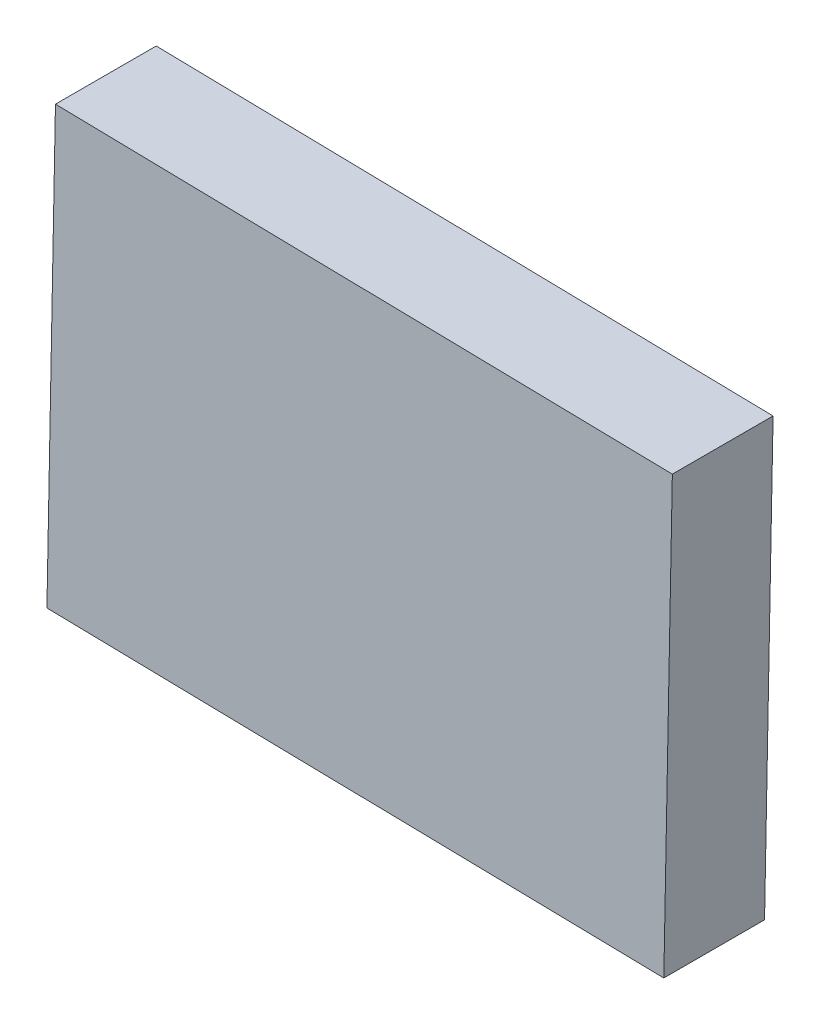
ISO-10303-21;
HEADER;
FILE_DESCRIPTION(('STEP AP214'),'2;1');
FILE_NAME('part.step','',(''),(''),'','','');
FILE_SCHEMA(('AUTOMOTIVE_DESIGN { 1 0 10303 214 1 1 1 1 }'));
ENDSEC;
DATA;
#1=APPLICATION_CONTEXT('core data for automotive mechanical design processes');
#2=APPLICATION_PROTOCOL_DEFINITION('international standard','automotive_design',2000,#1);
#3=PRODUCT_CONTEXT('',#1,'mechanical');
#4=PRODUCT('Part','Part','',(#3));
#5=PRODUCT_RELATED_PRODUCT_CATEGORY('part','',(#4));
#6=PRODUCT_DEFINITION_FORMATION('','',#4);
#7=PRODUCT_DEFINITION_CONTEXT('part definition',#1,'design');
#8=PRODUCT_DEFINITION('design','',#6,#7);
#9=PRODUCT_DEFINITION_SHAPE('','',#8);
#10=(LENGTH_UNIT() NAMED_UNIT(*) SI_UNIT(.MILLI.,.METRE.));
#11=(NAMED_UNIT(*) PLANE_ANGLE_UNIT() SI_UNIT($,.RADIAN.));
#12=(NAMED_UNIT(*) SI_UNIT($,.STERADIAN.) SOLID_ANGLE_UNIT());
#13=UNCERTAINTY_MEASURE_WITH_UNIT(LENGTH_MEASURE(1.E-05),#10,'distance_accuracy_value','');
#14=(GEOMETRIC_REPRESENTATION_CONTEXT(3) GLOBAL_UNCERTAINTY_ASSIGNED_CONTEXT((#13)) GLOBAL_UNIT_ASSIGNED_CONTEXT((#10,
#11,#12)) REPRESENTATION_CONTEXT('',''));
#15=CARTESIAN_POINT('',(0.,0.,0.));
#16=DIRECTION('',(0.,0.,1.));
#17=DIRECTION('',(1.,0.,0.));
#18=AXIS2_PLACEMENT_3D('',#15,#16,#17);
#19=CARTESIAN_POINT('',(-1.71669371262008,0.557184606220066,38.2500965279299));
#20=DIRECTION('',(0.,0.,-1.));
#21=DIRECTION('',(-0.0193548335692301,-0.999812677663925,0.));
#22=AXIS2_PLACEMENT_3D('',#19,#20,#21);
#23=PLANE('',#22);
#24=DIRECTION('',(-0.0193548335692301,-0.999812677663925,0.));
#25=VECTOR('',#24,1.);
#26=CARTESIAN_POINT('',(4.59117281569775,4.88090682913489,38.25009652793));
#27=LINE('',#26,#25);
#28=CARTESIAN_POINT('',(4.59117281569775,4.88090682913489,38.25009652793));
#29=VERTEX_POINT('',#28);
#30=CARTESIAN_POINT('',(4.4191083452673,-4.0074278752974,38.2500965279301));
#31=VERTEX_POINT('',#30);
#32=EDGE_CURVE('E59',#29,#31,#27,.T.);
#33=ORIENTED_EDGE('',*,*,#32,.T.);
#34=DIRECTION('',(-0.999812677663925,0.0193548335692301,0.));
#35=VECTOR('',#34,1.);
#36=CARTESIAN_POINT('',(4.4191083452673,-4.0074278752974,38.2500965279301));
#37=LINE('',#36,#35);
#38=CARTESIAN_POINT('',(-8.02456024093791,-3.76653761669476,38.2500965279297));
#39=VERTEX_POINT('',#38);
#40=EDGE_CURVE('E20',#31,#39,#37,.T.);
#41=ORIENTED_EDGE('',*,*,#40,.T.);
#42=DIRECTION('',(0.0193548335692301,0.999812677663925,0.));
#43=VECTOR('',#42,1.);
#44=CARTESIAN_POINT('',(-7.85249577050745,5.12179708773753,38.2500965279296));
#45=LINE('',#44,#43);
#46=CARTESIAN_POINT('',(-7.85249577050745,5.12179708773753,38.2500965279296));
#47=VERTEX_POINT('',#46);
#48=EDGE_CURVE('E56',#39,#47,#45,.T.);
#49=ORIENTED_EDGE('',*,*,#48,.T.);
#50=DIRECTION('',(0.999812677663925,-0.0193548335692301,0.));
#51=VECTOR('',#50,1.);
#52=CARTESIAN_POINT('',(4.59117281569775,4.88090682913489,38.25009652793));
#53=LINE('',#52,#51);
#54=EDGE_CURVE('E84',#47,#29,#53,.T.);
#55=ORIENTED_EDGE('',*,*,#54,.T.);
#56=EDGE_LOOP('',(#33,#41,#49,#55));
#57=FACE_BOUND('',#56,.T.);
#58=ADVANCED_FACE('F17',(#57),#23,.T.);
#59=CARTESIAN_POINT('',(4.41910834526723,-4.00742787529737,40.2820965279302));
#60=DIRECTION('',(0.0193548335692301,0.999812677663925,0.));
#61=DIRECTION('',(-0.999812677663925,0.0193548335692301,0.));
#62=AXIS2_PLACEMENT_3D('',#59,#60,#61);
#63=PLANE('',#62);
#64=DIRECTION('',(0.,0.,1.));
#65=VECTOR('',#64,1.);
#66=CARTESIAN_POINT('',(-8.02456024093798,-3.76653761669474,40.2820965279298));
#67=LINE('',#66,#65);
#68=CARTESIAN_POINT('',(-8.02456024093798,-3.76653761669474,40.2820965279298));
#69=VERTEX_POINT('',#68);
#70=EDGE_CURVE('E65',#69,#39,#67,.F.);
#71=ORIENTED_EDGE('',*,*,#70,.T.);
#72=ORIENTED_EDGE('',*,*,#40,.F.);
#73=DIRECTION('',(0.,0.,1.));
#74=VECTOR('',#73,1.);
#75=CARTESIAN_POINT('',(4.41910834526723,-4.00742787529737,40.2820965279302));
#76=LINE('',#75,#74);
#77=CARTESIAN_POINT('',(4.41910834526723,-4.00742787529737,40.2820965279302));
#78=VERTEX_POINT('',#77);
#79=EDGE_CURVE('E89',#31,#78,#76,.T.);
#80=ORIENTED_EDGE('',*,*,#79,.T.);
#81=DIRECTION('',(-0.999812677663925,0.0193548335692301,0.));
#82=VECTOR('',#81,1.);
#83=CARTESIAN_POINT('',(-1.80272594783537,-3.88698274599605,40.28209652793));
#84=LINE('',#83,#82);
#85=EDGE_CURVE('E76',#78,#69,#84,.T.);
#86=ORIENTED_EDGE('',*,*,#85,.T.);
#87=EDGE_LOOP('',(#71,#72,#80,#86));
#88=FACE_BOUND('',#87,.T.);
#89=ADVANCED_FACE('F75',(#88),#63,.F.);
#90=CARTESIAN_POINT('',(-7.85249577050752,5.12179708773756,40.2820965279296));
#91=DIRECTION('',(0.999812677663925,-0.0193548335692301,0.));
#92=DIRECTION('',(0.0193548335692301,0.999812677663925,0.));
#93=AXIS2_PLACEMENT_3D('',#90,#91,#92);
#94=PLANE('',#93);
#95=DIRECTION('',(0.,0.,1.));
#96=VECTOR('',#95,1.);
#97=CARTESIAN_POINT('',(-7.85249577050752,5.12179708773756,40.2820965279296));
#98=LINE('',#97,#96);
#99=CARTESIAN_POINT('',(-7.85249577050752,5.12179708773756,40.2820965279296));
#100=VERTEX_POINT('',#99);
#101=EDGE_CURVE('E71',#100,#47,#98,.F.);
#102=ORIENTED_EDGE('',*,*,#101,.T.);
#103=ORIENTED_EDGE('',*,*,#48,.F.);
#104=ORIENTED_EDGE('',*,*,#70,.F.);
#105=DIRECTION('',(-0.0193548335692301,-0.999812677663925,0.));
#106=VECTOR('',#105,1.);
#107=CARTESIAN_POINT('',(-7.93852800572275,0.677629735521414,40.2820965279297));
#108=LINE('',#107,#106);
#109=EDGE_CURVE('E94',#69,#100,#108,.F.);
#110=ORIENTED_EDGE('',*,*,#109,.T.);
#111=EDGE_LOOP('',(#102,#103,#104,#110));
#112=FACE_BOUND('',#111,.T.);
#113=ADVANCED_FACE('F68',(#112),#94,.F.);
#114=CARTESIAN_POINT('',(4.59117281569769,4.88090682913492,40.28209652793));
#115=DIRECTION('',(-0.0193548335692301,-0.999812677663925,0.));
#116=DIRECTION('',(0.999812677663925,-0.0193548335692301,0.));
#117=AXIS2_PLACEMENT_3D('',#114,#115,#116);
#118=PLANE('',#117);
#119=DIRECTION('',(0.,0.,1.));
#120=VECTOR('',#119,1.);
#121=CARTESIAN_POINT('',(4.59117281569769,4.88090682913492,40.28209652793));
#122=LINE('',#121,#120);
#123=CARTESIAN_POINT('',(4.59117281569769,4.88090682913492,40.28209652793));
#124=VERTEX_POINT('',#123);
#125=EDGE_CURVE('E35',#124,#29,#122,.F.);
#126=ORIENTED_EDGE('',*,*,#125,.T.);
#127=ORIENTED_EDGE('',*,*,#54,.F.);
#128=ORIENTED_EDGE('',*,*,#101,.F.);
#129=DIRECTION('',(-0.999812677663925,0.0193548335692301,0.));
#130=VECTOR('',#129,1.);
#131=CARTESIAN_POINT('',(-1.63066147740492,5.00135195843624,40.2820965279298));
#132=LINE('',#131,#130);
#133=EDGE_CURVE('E27',#100,#124,#132,.F.);
#134=ORIENTED_EDGE('',*,*,#133,.T.);
#135=EDGE_LOOP('',(#126,#127,#128,#134));
#136=FACE_BOUND('',#135,.T.);
#137=ADVANCED_FACE('F101',(#136),#118,.F.);
#138=CARTESIAN_POINT('',(4.59117281569769,4.88090682913492,40.28209652793));
#139=DIRECTION('',(-0.999812677663925,0.0193548335692301,0.));
#140=DIRECTION('',(-0.0193548335692301,-0.999812677663925,0.));
#141=AXIS2_PLACEMENT_3D('',#138,#139,#140);
#142=PLANE('',#141);
#143=ORIENTED_EDGE('',*,*,#79,.F.);
#144=ORIENTED_EDGE('',*,*,#32,.F.);
#145=ORIENTED_EDGE('',*,*,#125,.F.);
#146=DIRECTION('',(-0.0193548335692301,-0.999812677663925,0.));
#147=VECTOR('',#146,1.);
#148=CARTESIAN_POINT('',(4.50514058048246,0.436739476918776,40.2820965279301));
#149=LINE('',#148,#147);
#150=EDGE_CURVE('E11',#124,#78,#149,.T.);
#151=ORIENTED_EDGE('',*,*,#150,.T.);
#152=EDGE_LOOP('',(#143,#144,#145,#151));
#153=FACE_BOUND('',#152,.T.);
#154=ADVANCED_FACE('F104',(#153),#142,.F.);
#155=CARTESIAN_POINT('',(-1.71669371262014,0.557184606220095,40.2820965279299));
#156=DIRECTION('',(0.,0.,-1.));
#157=DIRECTION('',(-0.0193548335692301,-0.999812677663925,0.));
#158=AXIS2_PLACEMENT_3D('',#155,#156,#157);
#159=PLANE('',#158);
#160=ORIENTED_EDGE('',*,*,#133,.F.);
#161=ORIENTED_EDGE('',*,*,#109,.F.);
#162=ORIENTED_EDGE('',*,*,#85,.F.);
#163=ORIENTED_EDGE('',*,*,#150,.F.);
#164=EDGE_LOOP('',(#160,#161,#162,#163));
#165=FACE_BOUND('',#164,.T.);
#166=ADVANCED_FACE('F103',(#165),#159,.F.);
#167=CLOSED_SHELL('',(#58,#89,#113,#137,#154,#166));
#168=MANIFOLD_SOLID_BREP('B1',#167);
#169=ADVANCED_BREP_SHAPE_REPRESENTATION('',(#18,#168),#14);
#170=SHAPE_DEFINITION_REPRESENTATION(#9,#169);
ENDSEC;
END-ISO-10303-21;
